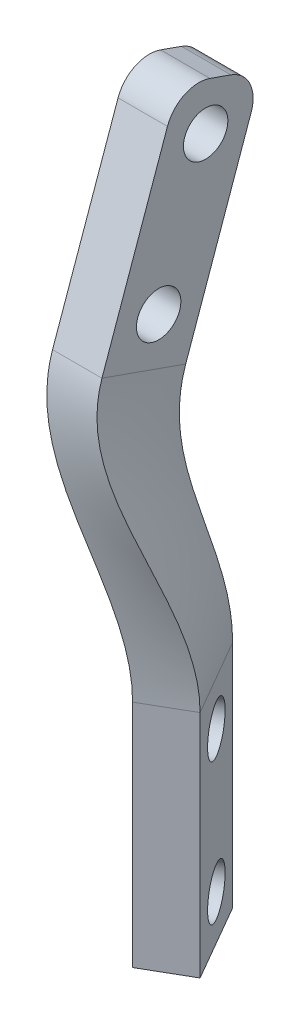
ISO-10303-21;
HEADER;
FILE_DESCRIPTION(('STEP AP214'),'2;1');
FILE_NAME('part.step','',(''),(''),'','','');
FILE_SCHEMA(('AUTOMOTIVE_DESIGN { 1 0 10303 214 1 1 1 1 }'));
ENDSEC;
DATA;
#1=APPLICATION_CONTEXT('core data for automotive mechanical design processes');
#2=APPLICATION_PROTOCOL_DEFINITION('international standard','automotive_design',2000,#1);
#3=PRODUCT_CONTEXT('',#1,'mechanical');
#4=PRODUCT('Part','Part','',(#3));
#5=PRODUCT_RELATED_PRODUCT_CATEGORY('part','',(#4));
#6=PRODUCT_DEFINITION_FORMATION('','',#4);
#7=PRODUCT_DEFINITION_CONTEXT('part definition',#1,'design');
#8=PRODUCT_DEFINITION('design','',#6,#7);
#9=PRODUCT_DEFINITION_SHAPE('','',#8);
#10=(LENGTH_UNIT() NAMED_UNIT(*) SI_UNIT(.MILLI.,.METRE.));
#11=(NAMED_UNIT(*) PLANE_ANGLE_UNIT() SI_UNIT($,.RADIAN.));
#12=(NAMED_UNIT(*) SI_UNIT($,.STERADIAN.) SOLID_ANGLE_UNIT());
#13=UNCERTAINTY_MEASURE_WITH_UNIT(LENGTH_MEASURE(1.E-05),#10,'distance_accuracy_value','');
#14=(GEOMETRIC_REPRESENTATION_CONTEXT(3) GLOBAL_UNCERTAINTY_ASSIGNED_CONTEXT((#13)) GLOBAL_UNIT_ASSIGNED_CONTEXT((#10,
#11,#12)) REPRESENTATION_CONTEXT('',''));
#15=CARTESIAN_POINT('',(0.,0.,0.));
#16=DIRECTION('',(0.,0.,1.));
#17=DIRECTION('',(1.,0.,0.));
#18=AXIS2_PLACEMENT_3D('',#15,#16,#17);
#19=CARTESIAN_POINT('',(-105.736696704946,0.,61.0471103058222));
#20=DIRECTION('',(0.866025403784439,0.,-0.5));
#21=DIRECTION('',(-0.5,0.,-0.866025403784439));
#22=AXIS2_PLACEMENT_3D('',#19,#20,#21);
#23=PLANE('',#22);
#24=CARTESIAN_POINT('',(-190.650199856964,-33.1766332140993,-86.0273914021332));
#25=DIRECTION('',(0.866025403784438,0.,-0.500000000000001));
#26=DIRECTION('',(-0.500000000000001,0.,-0.866025403784438));
#27=AXIS2_PLACEMENT_3D('',#24,#25,#26);
#28=CIRCLE('',#27,2.15000000000005);
#29=CARTESIAN_POINT('',(-191.725199856964,-33.1766332140993,-87.8893460202698));
#30=VERTEX_POINT('',#29);
#31=EDGE_CURVE('E716',#30,#30,#28,.T.);
#32=ORIENTED_EDGE('',*,*,#31,.F.);
#33=EDGE_LOOP('',(#32));
#34=FACE_BOUND('',#33,.T.);
#35=DIRECTION('',(0.,-1.,0.));
#36=VECTOR('',#35,1.);
#37=CARTESIAN_POINT('',(-188.650199856964,-16.4766332140994,-82.5632897869954));
#38=LINE('',#37,#36);
#39=CARTESIAN_POINT('',(-188.650199856964,-16.4766332140993,-82.5632897869954));
#40=VERTEX_POINT('',#39);
#41=CARTESIAN_POINT('',(-188.650199856964,-37.1766332140993,-82.5632897869954));
#42=VERTEX_POINT('',#41);
#43=EDGE_CURVE('E701',#40,#42,#38,.T.);
#44=ORIENTED_EDGE('',*,*,#43,.T.);
#45=DIRECTION('',(-0.5,0.,-0.866025403784439));
#46=VECTOR('',#45,1.);
#47=CARTESIAN_POINT('',(-188.650199856964,-37.1766332140993,-82.5632897869954));
#48=LINE('',#47,#46);
#49=CARTESIAN_POINT('',(-192.650199856964,-37.1766332140993,-89.4914930172709));
#50=VERTEX_POINT('',#49);
#51=EDGE_CURVE('E712',#42,#50,#48,.T.);
#52=ORIENTED_EDGE('',*,*,#51,.T.);
#53=DIRECTION('',(0.,1.,0.));
#54=VECTOR('',#53,1.);
#55=CARTESIAN_POINT('',(-192.650199856964,-16.4766332140993,-89.4914930172709));
#56=LINE('',#55,#54);
#57=CARTESIAN_POINT('',(-192.650199856964,-16.4766332140993,-89.4914930172709));
#58=VERTEX_POINT('',#57);
#59=EDGE_CURVE('E709',#50,#58,#56,.T.);
#60=ORIENTED_EDGE('',*,*,#59,.T.);
#61=DIRECTION('',(-0.5,0.,-0.866025403784439));
#62=VECTOR('',#61,1.);
#63=CARTESIAN_POINT('',(-105.736696704946,-16.4766332140993,61.0471103058222));
#64=LINE('',#63,#62);
#65=EDGE_CURVE('E711',#58,#40,#64,.F.);
#66=ORIENTED_EDGE('',*,*,#65,.T.);
#67=EDGE_LOOP('',(#44,#52,#60,#66));
#68=FACE_BOUND('',#67,.T.);
#69=CARTESIAN_POINT('',(-190.650199856964,-20.4766332140994,-86.0273914021332));
#70=DIRECTION('',(0.866025403784438,0.,-0.500000000000001));
#71=DIRECTION('',(-0.500000000000001,0.,-0.866025403784438));
#72=AXIS2_PLACEMENT_3D('',#69,#70,#71);
#73=CIRCLE('',#72,2.15000000000005);
#74=CARTESIAN_POINT('',(-191.725199856964,-20.4766332140994,-87.8893460202698));
#75=VERTEX_POINT('',#74);
#76=EDGE_CURVE('E818',#75,#75,#73,.T.);
#77=ORIENTED_EDGE('',*,*,#76,.F.);
#78=EDGE_LOOP('',(#77));
#79=FACE_BOUND('',#78,.T.);
#80=ADVANCED_FACE('F279',(#34,#68,#79),#23,.T.);
#81=CARTESIAN_POINT('',(-109.590509751786,0.,63.2721103058222));
#82=DIRECTION('',(0.866025403784439,0.,-0.5));
#83=DIRECTION('',(-0.5,0.,-0.866025403784439));
#84=AXIS2_PLACEMENT_3D('',#81,#82,#83);
#85=PLANE('',#84);
#86=DIRECTION('',(0.,-1.,0.));
#87=VECTOR('',#86,1.);
#88=CARTESIAN_POINT('',(-192.504012903805,-16.4766332140994,-80.3382897869954));
#89=LINE('',#88,#87);
#90=CARTESIAN_POINT('',(-192.504012903805,-16.4766332140994,-80.3382897869954));
#91=VERTEX_POINT('',#90);
#92=CARTESIAN_POINT('',(-192.504012903805,-37.1766332140993,-80.3382897869954));
#93=VERTEX_POINT('',#92);
#94=EDGE_CURVE('E703',#91,#93,#89,.T.);
#95=ORIENTED_EDGE('',*,*,#94,.F.);
#96=DIRECTION('',(-0.5,0.,-0.866025403784439));
#97=VECTOR('',#96,1.);
#98=CARTESIAN_POINT('',(-109.590509751786,-16.4766332140994,63.2721103058222));
#99=LINE('',#98,#97);
#100=CARTESIAN_POINT('',(-196.504012903805,-16.4766332140993,-87.2664930172709));
#101=VERTEX_POINT('',#100);
#102=EDGE_CURVE('E698',#101,#91,#99,.F.);
#103=ORIENTED_EDGE('',*,*,#102,.F.);
#104=DIRECTION('',(0.,1.,0.));
#105=VECTOR('',#104,1.);
#106=CARTESIAN_POINT('',(-196.504012903805,-16.4766332140993,-87.2664930172709));
#107=LINE('',#106,#105);
#108=CARTESIAN_POINT('',(-196.504012903805,-37.1766332140993,-87.2664930172709));
#109=VERTEX_POINT('',#108);
#110=EDGE_CURVE('E692',#109,#101,#107,.T.);
#111=ORIENTED_EDGE('',*,*,#110,.F.);
#112=DIRECTION('',(-0.5,0.,-0.866025403784439));
#113=VECTOR('',#112,1.);
#114=CARTESIAN_POINT('',(-192.504012903805,-37.1766332140993,-80.3382897869954));
#115=LINE('',#114,#113);
#116=EDGE_CURVE('E699',#93,#109,#115,.T.);
#117=ORIENTED_EDGE('',*,*,#116,.F.);
#118=EDGE_LOOP('',(#95,#103,#111,#117));
#119=FACE_BOUND('',#118,.T.);
#120=CARTESIAN_POINT('',(-194.504012903805,-33.1766332140993,-83.8023914021332));
#121=DIRECTION('',(0.866025403784438,0.,-0.500000000000001));
#122=DIRECTION('',(-0.500000000000001,0.,-0.866025403784438));
#123=AXIS2_PLACEMENT_3D('',#120,#121,#122);
#124=CIRCLE('',#123,2.15000000000005);
#125=CARTESIAN_POINT('',(-195.579012903805,-33.1766332140993,-85.6643460202698));
#126=VERTEX_POINT('',#125);
#127=EDGE_CURVE('E821',#126,#126,#124,.T.);
#128=ORIENTED_EDGE('',*,*,#127,.T.);
#129=EDGE_LOOP('',(#128));
#130=FACE_BOUND('',#129,.T.);
#131=CARTESIAN_POINT('',(-194.504012903805,-20.4766332140994,-83.8023914021332));
#132=DIRECTION('',(0.866025403784438,0.,-0.500000000000001));
#133=DIRECTION('',(-0.500000000000001,0.,-0.866025403784438));
#134=AXIS2_PLACEMENT_3D('',#131,#132,#133);
#135=CIRCLE('',#134,2.15000000000005);
#136=CARTESIAN_POINT('',(-195.579012903805,-20.4766332140994,-85.6643460202698));
#137=VERTEX_POINT('',#136);
#138=EDGE_CURVE('E822',#137,#137,#135,.T.);
#139=ORIENTED_EDGE('',*,*,#138,.T.);
#140=EDGE_LOOP('',(#139));
#141=FACE_BOUND('',#140,.T.);
#142=ADVANCED_FACE('F493',(#119,#130,#141),#85,.F.);
#143=CARTESIAN_POINT('',(-188.650199856964,-16.4766332140994,-82.5632897869954));
#144=DIRECTION('',(-0.500000000000001,0.,-0.866025403784438));
#145=DIRECTION('',(-0.866025403784438,0.,0.500000000000001));
#146=AXIS2_PLACEMENT_3D('',#143,#144,#145);
#147=PLANE('',#146);
#148=ORIENTED_EDGE('',*,*,#94,.T.);
#149=DIRECTION('',(-0.866025403784438,0.,0.500000000000001));
#150=VECTOR('',#149,1.);
#151=CARTESIAN_POINT('',(-188.650199856964,-37.1766332140993,-82.5632897869954));
#152=LINE('',#151,#150);
#153=EDGE_CURVE('E707',#42,#93,#152,.T.);
#154=ORIENTED_EDGE('',*,*,#153,.F.);
#155=ORIENTED_EDGE('',*,*,#43,.F.);
#156=DIRECTION('',(-0.866025403784438,0.,0.500000000000001));
#157=VECTOR('',#156,1.);
#158=CARTESIAN_POINT('',(-188.650199856964,-16.4766332140994,-82.5632897869954));
#159=LINE('',#158,#157);
#160=EDGE_CURVE('E719',#40,#91,#159,.T.);
#161=ORIENTED_EDGE('',*,*,#160,.T.);
#162=EDGE_LOOP('',(#148,#154,#155,#161));
#163=FACE_BOUND('',#162,.T.);
#164=ADVANCED_FACE('F545',(#163),#147,.F.);
#165=CARTESIAN_POINT('',(-188.650199856964,-37.1766332140993,-82.5632897869954));
#166=DIRECTION('',(0.,1.,0.));
#167=DIRECTION('',(-1.,0.,0.));
#168=AXIS2_PLACEMENT_3D('',#165,#166,#167);
#169=PLANE('',#168);
#170=ORIENTED_EDGE('',*,*,#116,.T.);
#171=DIRECTION('',(-0.866025403784438,0.,0.500000000000001));
#172=VECTOR('',#171,1.);
#173=CARTESIAN_POINT('',(-192.650199856964,-37.1766332140993,-89.4914930172709));
#174=LINE('',#173,#172);
#175=EDGE_CURVE('E696',#50,#109,#174,.T.);
#176=ORIENTED_EDGE('',*,*,#175,.F.);
#177=ORIENTED_EDGE('',*,*,#51,.F.);
#178=ORIENTED_EDGE('',*,*,#153,.T.);
#179=EDGE_LOOP('',(#170,#176,#177,#178));
#180=FACE_BOUND('',#179,.T.);
#181=ADVANCED_FACE('F554',(#180),#169,.F.);
#182=CARTESIAN_POINT('',(-192.650199856964,-16.4766332140993,-89.4914930172709));
#183=DIRECTION('',(0.500000000000001,0.,0.866025403784438));
#184=DIRECTION('',(0.866025403784438,0.,-0.500000000000001));
#185=AXIS2_PLACEMENT_3D('',#182,#183,#184);
#186=PLANE('',#185);
#187=ORIENTED_EDGE('',*,*,#110,.T.);
#188=DIRECTION('',(0.866025403784438,0.,-0.500000000000001));
#189=VECTOR('',#188,1.);
#190=CARTESIAN_POINT('',(-192.650199856964,-16.4766332140993,-89.4914930172709));
#191=LINE('',#190,#189);
#192=EDGE_CURVE('E367',#58,#101,#191,.F.);
#193=ORIENTED_EDGE('',*,*,#192,.F.);
#194=ORIENTED_EDGE('',*,*,#59,.F.);
#195=ORIENTED_EDGE('',*,*,#175,.T.);
#196=EDGE_LOOP('',(#187,#193,#194,#195));
#197=FACE_BOUND('',#196,.T.);
#198=ADVANCED_FACE('F489',(#197),#186,.F.);
#199=CARTESIAN_POINT('',(-190.650199856964,-33.1766332140993,-86.0273914021332));
#200=DIRECTION('',(-0.866025403784438,0.,0.500000000000001));
#201=DIRECTION('',(0.500000000000001,0.,0.866025403784438));
#202=AXIS2_PLACEMENT_3D('',#199,#200,#201);
#203=CYLINDRICAL_SURFACE('',#202,2.15000000000005);
#204=ORIENTED_EDGE('',*,*,#31,.T.);
#205=EDGE_LOOP('',(#204));
#206=FACE_BOUND('',#205,.T.);
#207=ORIENTED_EDGE('',*,*,#127,.F.);
#208=EDGE_LOOP('',(#207));
#209=FACE_BOUND('',#208,.T.);
#210=ADVANCED_FACE('F485',(#206,#209),#203,.F.);
#211=CARTESIAN_POINT('',(-190.650199856964,-20.4766332140994,-86.0273914021332));
#212=DIRECTION('',(-0.866025403784438,0.,0.500000000000001));
#213=DIRECTION('',(0.500000000000001,0.,0.866025403784438));
#214=AXIS2_PLACEMENT_3D('',#211,#212,#213);
#215=CYLINDRICAL_SURFACE('',#214,2.15000000000005);
#216=ORIENTED_EDGE('',*,*,#76,.T.);
#217=EDGE_LOOP('',(#216));
#218=FACE_BOUND('',#217,.T.);
#219=ORIENTED_EDGE('',*,*,#138,.F.);
#220=EDGE_LOOP('',(#219));
#221=FACE_BOUND('',#220,.T.);
#222=ADVANCED_FACE('F427',(#218,#221),#215,.F.);
#223=CARTESIAN_POINT('',(-192.504012903805,-16.4766332140994,-80.3382897869954));
#224=CARTESIAN_POINT('',(-192.504012903805,-7.53697597439596,-80.3382897869954));
#225=CARTESIAN_POINT('',(-197.091499962125,1.90145748462411,-74.8427636187892));
#226=CARTESIAN_POINT('',(-197.091499962125,10.0294230832178,-77.7164334147975));
#227=CARTESIAN_POINT('',(-191.861710729331,-16.4766332140994,-80.7091231203287));
#228=CARTESIAN_POINT('',(-191.861710729331,-7.53233491327276,-80.7091231203287));
#229=CARTESIAN_POINT('',(-196.349833295459,1.91262073999403,-74.8467104255753));
#230=CARTESIAN_POINT('',(-196.349833295459,10.0294230832178,-77.7164334147975));
#231=CARTESIAN_POINT('',(-190.577106380384,-16.4766332140994,-81.4507897869954));
#232=CARTESIAN_POINT('',(-190.577106380384,-7.52305279102637,-81.4507897869954));
#233=CARTESIAN_POINT('',(-194.866499962125,1.93494725073388,-74.8546040391475));
#234=CARTESIAN_POINT('',(-194.866499962125,10.0294230832178,-77.7164334147975));
#235=CARTESIAN_POINT('',(-189.292502031437,-16.4766332140994,-82.1924564536621));
#236=CARTESIAN_POINT('',(-189.292502031437,-7.50407146225316,-82.1924564536621));
#237=CARTESIAN_POINT('',(-193.383166628792,1.94812926186407,-74.8592645838774));
#238=CARTESIAN_POINT('',(-193.383166628792,10.0294230832178,-77.7164334147975));
#239=CARTESIAN_POINT('',(-188.650199856964,-16.4766332140994,-82.5632897869954));
#240=CARTESIAN_POINT('',(-188.650199856964,-7.49458079786655,-82.5632897869954));
#241=CARTESIAN_POINT('',(-192.641499962125,1.95472026742916,-74.8615948562424));
#242=CARTESIAN_POINT('',(-192.641499962125,10.0294230832178,-77.7164334147975));
#243=B_SPLINE_SURFACE_WITH_KNOTS('',3,3,((#223,#224,#225,#226),(#227,#228,#229,#230),(#231,#232,
#233,#234),(#235,#236,#237,#238),(#239,#240,#241,#242)),.UNSPECIFIED.,.F.,.F.,.F.,(4,1,4),(4,4),
(0.,0.5,1.),(0.,1.),.UNSPECIFIED.);
#244=CARTESIAN_POINT('',(-188.650199856964,-16.4766332140994,-82.5632897869954));
#245=CARTESIAN_POINT('',(-188.650199856964,-7.49458079786655,-82.5632897869954));
#246=CARTESIAN_POINT('',(-192.641499962125,1.95472026742916,-74.8615948562424));
#247=CARTESIAN_POINT('',(-192.641499962125,10.0294230832178,-77.7164334147975));
#248=B_SPLINE_CURVE_WITH_KNOTS('',3,(#244,#245,#246,#247),.UNSPECIFIED.,.F.,.F.,(4,4),(0.,1.),.UNSPECIFIED.);
#249=CARTESIAN_POINT('',(-192.641499962125,10.0294230832178,-77.7164334147975));
#250=VERTEX_POINT('',#249);
#251=EDGE_CURVE('E729',#40,#250,#248,.T.);
#252=DIRECTION('',(-1.,0.,0.));
#253=VECTOR('',#252,1.);
#254=CARTESIAN_POINT('',(-192.641499962125,10.0294230832178,-77.7164334147975));
#255=LINE('',#254,#253);
#256=CARTESIAN_POINT('',(-197.091499962125,10.0294230832178,-77.7164334147975));
#257=VERTEX_POINT('',#256);
#258=EDGE_CURVE('E728',#250,#257,#255,.T.);
#259=CARTESIAN_POINT('',(-192.504012903805,-16.4766332140994,-80.3382897869954));
#260=CARTESIAN_POINT('',(-192.504012903805,-7.53697597439596,-80.3382897869954));
#261=CARTESIAN_POINT('',(-197.091499962125,1.90145748462411,-74.8427636187892));
#262=CARTESIAN_POINT('',(-197.091499962125,10.0294230832178,-77.7164334147975));
#263=B_SPLINE_CURVE_WITH_KNOTS('',3,(#259,#260,#261,#262),.UNSPECIFIED.,.F.,.F.,(4,4),(0.,1.),.UNSPECIFIED.);
#264=EDGE_CURVE('E379',#257,#91,#263,.F.);
#265=ORIENTED_EDGE('',*,*,#160,.F.);
#266=ORIENTED_EDGE('',*,*,#251,.T.);
#267=ORIENTED_EDGE('',*,*,#258,.T.);
#268=ORIENTED_EDGE('',*,*,#264,.T.);
#269=EDGE_LOOP('',(#265,#266,#267,#268));
#270=FACE_BOUND('',#269,.T.);
#271=ADVANCED_FACE('F420',(#270),#243,.T.);
#272=CARTESIAN_POINT('',(-188.650199856964,-16.4766332140994,-82.5632897869954));
#273=CARTESIAN_POINT('',(-188.650199856964,-7.49458079786655,-82.5632897869954));
#274=CARTESIAN_POINT('',(-192.641499962125,1.95472026742916,-74.8615948562424));
#275=CARTESIAN_POINT('',(-192.641499962125,10.0294230832178,-77.7164334147975));
#276=CARTESIAN_POINT('',(-189.31686652363,-16.4766332140994,-83.7179903253747));
#277=CARTESIAN_POINT('',(-189.31686652363,-7.66172065508388,-83.7179903253747));
#278=CARTESIAN_POINT('',(-192.641499962125,1.66037160872435,-76.1717404523138));
#279=CARTESIAN_POINT('',(-192.641499962125,9.58497863877331,-78.9735121369069));
#280=CARTESIAN_POINT('',(-190.650199856964,-16.4766332140993,-86.0273914021332));
#281=CARTESIAN_POINT('',(-190.650199856964,-7.99600036951852,-86.0273914021332));
#282=CARTESIAN_POINT('',(-192.641499962125,1.07167429131473,-78.7920316444567));
#283=CARTESIAN_POINT('',(-192.641499962125,8.69608974988443,-81.4876695811257));
#284=CARTESIAN_POINT('',(-191.983533190297,-16.4766332140993,-88.3367924788917));
#285=CARTESIAN_POINT('',(-191.983533190297,-8.30240337284036,-88.3367924788917));
#286=CARTESIAN_POINT('',(-192.641499962125,0.456694558618404,-81.4030305995619));
#287=CARTESIAN_POINT('',(-192.641499962125,7.80720086099554,-84.0018270253446));
#288=CARTESIAN_POINT('',(-192.650199856964,-16.4766332140993,-89.4914930172709));
#289=CARTESIAN_POINT('',(-192.650199856964,-8.45560487450128,-89.4914930172709));
#290=CARTESIAN_POINT('',(-192.641499962125,0.149204692270239,-82.7085300771145));
#291=CARTESIAN_POINT('',(-192.641499962125,7.3627564165511,-85.258905747454));
#292=B_SPLINE_SURFACE_WITH_KNOTS('',3,3,((#272,#273,#274,#275),(#276,#277,#278,#279),(#280,#281,
#282,#283),(#284,#285,#286,#287),(#288,#289,#290,#291)),.UNSPECIFIED.,.F.,.F.,.F.,(4,1,4),(4,4),
(0.,0.5,1.),(0.,1.),.UNSPECIFIED.);
#293=CARTESIAN_POINT('',(-192.650199856964,-16.4766332140993,-89.4914930172709));
#294=CARTESIAN_POINT('',(-192.650199856964,-8.45560487450128,-89.4914930172709));
#295=CARTESIAN_POINT('',(-192.641499962125,0.149204692270239,-82.7085300771145));
#296=CARTESIAN_POINT('',(-192.641499962125,7.3627564165511,-85.258905747454));
#297=B_SPLINE_CURVE_WITH_KNOTS('',3,(#293,#294,#295,#296),.UNSPECIFIED.,.F.,.F.,(4,4),(0.,1.),.UNSPECIFIED.);
#298=CARTESIAN_POINT('',(-192.641499962125,7.3627564165511,-85.258905747454));
#299=VERTEX_POINT('',#298);
#300=EDGE_CURVE('E371',#58,#299,#297,.T.);
#301=DIRECTION('',(0.,-0.333333333333333,-0.942809041582064));
#302=VECTOR('',#301,1.);
#303=CARTESIAN_POINT('',(-192.641499962125,10.0294230832178,-77.7164334147975));
#304=LINE('',#303,#302);
#305=EDGE_CURVE('E399',#250,#299,#304,.T.);
#306=ORIENTED_EDGE('',*,*,#65,.F.);
#307=ORIENTED_EDGE('',*,*,#300,.T.);
#308=ORIENTED_EDGE('',*,*,#305,.F.);
#309=ORIENTED_EDGE('',*,*,#251,.F.);
#310=EDGE_LOOP('',(#306,#307,#308,#309));
#311=FACE_BOUND('',#310,.T.);
#312=ADVANCED_FACE('F426',(#311),#292,.T.);
#313=CARTESIAN_POINT('',(-196.504012903805,-16.4766332140993,-87.2664930172709));
#314=CARTESIAN_POINT('',(-196.504012903805,-8.51185091922592,-87.2664930172709));
#315=CARTESIAN_POINT('',(-197.091499962125,0.10900063323341,-82.6943157957264));
#316=CARTESIAN_POINT('',(-197.091499962125,7.3627564165511,-85.258905747454));
#317=CARTESIAN_POINT('',(-195.837346237138,-16.4766332140993,-86.1117924788917));
#318=CARTESIAN_POINT('',(-195.837346237138,-8.35619994366006,-86.1117924788917));
#319=CARTESIAN_POINT('',(-197.091499962125,0.414181113436894,-81.3879998268722));
#320=CARTESIAN_POINT('',(-197.091499962125,7.80720086099554,-84.0018270253446));
#321=CARTESIAN_POINT('',(-194.504012903805,-16.4766332140993,-83.8023914021332));
#322=CARTESIAN_POINT('',(-194.504012903805,-8.04489799252836,-83.8023914021332));
#323=CARTESIAN_POINT('',(-197.091499962125,1.02454207384386,-78.7753678891636));
#324=CARTESIAN_POINT('',(-197.091499962125,8.69608974988443,-81.4876695811257));
#325=CARTESIAN_POINT('',(-193.170679570471,-16.4766332140994,-81.4929903253747));
#326=CARTESIAN_POINT('',(-193.170679570471,-7.70628331377343,-81.4929903253747));
#327=CARTESIAN_POINT('',(-197.091499962125,1.60915234769736,-76.153631708914));
#328=CARTESIAN_POINT('',(-197.091499962125,9.58497863877331,-78.9735121369069));
#329=CARTESIAN_POINT('',(-192.504012903805,-16.4766332140994,-80.3382897869954));
#330=CARTESIAN_POINT('',(-192.504012903805,-7.53697597439596,-80.3382897869954));
#331=CARTESIAN_POINT('',(-197.091499962125,1.9014574846241,-74.8427636187892));
#332=CARTESIAN_POINT('',(-197.091499962125,10.0294230832178,-77.7164334147975));
#333=B_SPLINE_SURFACE_WITH_KNOTS('',3,3,((#313,#314,#315,#316),(#317,#318,#319,#320),(#321,#322,
#323,#324),(#325,#326,#327,#328),(#329,#330,#331,#332)),.UNSPECIFIED.,.F.,.F.,.F.,(4,1,4),(4,4),
(0.,0.5,1.),(0.,1.),.UNSPECIFIED.);
#334=DIRECTION('',(0.,-0.333333333333333,-0.942809041582064));
#335=VECTOR('',#334,1.);
#336=CARTESIAN_POINT('',(-197.091499962125,10.0294230832178,-77.7164334147975));
#337=LINE('',#336,#335);
#338=CARTESIAN_POINT('',(-197.091499962125,7.3627564165511,-85.258905747454));
#339=VERTEX_POINT('',#338);
#340=EDGE_CURVE('E370',#257,#339,#337,.T.);
#341=CARTESIAN_POINT('',(-196.504012903805,-16.4766332140993,-87.2664930172709));
#342=CARTESIAN_POINT('',(-196.504012903805,-8.51185091922592,-87.2664930172709));
#343=CARTESIAN_POINT('',(-197.091499962125,0.10900063323341,-82.6943157957264));
#344=CARTESIAN_POINT('',(-197.091499962125,7.3627564165511,-85.258905747454));
#345=B_SPLINE_CURVE_WITH_KNOTS('',3,(#341,#342,#343,#344),.UNSPECIFIED.,.F.,.F.,(4,4),(0.,1.),.UNSPECIFIED.);
#346=EDGE_CURVE('E358',#101,#339,#345,.T.);
#347=ORIENTED_EDGE('',*,*,#102,.T.);
#348=ORIENTED_EDGE('',*,*,#264,.F.);
#349=ORIENTED_EDGE('',*,*,#340,.T.);
#350=ORIENTED_EDGE('',*,*,#346,.F.);
#351=EDGE_LOOP('',(#347,#348,#349,#350));
#352=FACE_BOUND('',#351,.T.);
#353=ADVANCED_FACE('F377',(#352),#333,.T.);
#354=CARTESIAN_POINT('',(-192.650199856964,-16.4766332140993,-89.4914930172709));
#355=CARTESIAN_POINT('',(-192.650199856964,-8.45560487450128,-89.4914930172709));
#356=CARTESIAN_POINT('',(-192.641499962125,0.149204692270239,-82.7085300771145));
#357=CARTESIAN_POINT('',(-192.641499962125,7.3627564165511,-85.258905747454));
#358=CARTESIAN_POINT('',(-193.292502031437,-16.4766332140993,-89.1206596839376));
#359=CARTESIAN_POINT('',(-193.292502031437,-8.46769503168226,-89.1206596839376));
#360=CARTESIAN_POINT('',(-193.383166628792,0.145064512015209,-82.7070663023477));
#361=CARTESIAN_POINT('',(-193.383166628792,7.3627564165511,-85.258905747454));
#362=CARTESIAN_POINT('',(-194.577106380384,-16.4766332140993,-88.3789930172709));
#363=CARTESIAN_POINT('',(-194.577106380384,-8.49187534604422,-88.3789930172709));
#364=CARTESIAN_POINT('',(-194.866499962125,0.136784151505148,-82.704138752814));
#365=CARTESIAN_POINT('',(-194.866499962125,7.3627564165511,-85.258905747454));
#366=CARTESIAN_POINT('',(-195.861710729331,-16.4766332140993,-87.6373263506043));
#367=CARTESIAN_POINT('',(-195.861710729331,-8.50519239483202,-87.6373263506042));
#368=CARTESIAN_POINT('',(-196.349833295459,0.118261805990655,-82.6975901147556));
#369=CARTESIAN_POINT('',(-196.349833295459,7.3627564165511,-85.258905747454));
#370=CARTESIAN_POINT('',(-196.504012903805,-16.4766332140993,-87.2664930172709));
#371=CARTESIAN_POINT('',(-196.504012903805,-8.51185091922592,-87.2664930172709));
#372=CARTESIAN_POINT('',(-197.091499962125,0.10900063323341,-82.6943157957264));
#373=CARTESIAN_POINT('',(-197.091499962125,7.3627564165511,-85.258905747454));
#374=B_SPLINE_SURFACE_WITH_KNOTS('',3,3,((#354,#355,#356,#357),(#358,#359,#360,#361),(#362,#363,
#364,#365),(#366,#367,#368,#369),(#370,#371,#372,#373)),.UNSPECIFIED.,.F.,.F.,.F.,(4,1,4),(4,4),
(0.,0.5,1.),(0.,1.),.UNSPECIFIED.);
#375=DIRECTION('',(-1.,0.,0.));
#376=VECTOR('',#375,1.);
#377=CARTESIAN_POINT('',(-192.641499962125,7.3627564165511,-85.258905747454));
#378=LINE('',#377,#376);
#379=EDGE_CURVE('E363',#299,#339,#378,.T.);
#380=ORIENTED_EDGE('',*,*,#192,.T.);
#381=ORIENTED_EDGE('',*,*,#346,.T.);
#382=ORIENTED_EDGE('',*,*,#379,.F.);
#383=ORIENTED_EDGE('',*,*,#300,.F.);
#384=EDGE_LOOP('',(#380,#381,#382,#383));
#385=FACE_BOUND('',#384,.T.);
#386=ADVANCED_FACE('F360',(#385),#374,.T.);
#387=CARTESIAN_POINT('',(-192.641499962125,0.,0.));
#388=DIRECTION('',(1.,0.,0.));
#389=DIRECTION('',(0.,0.,-1.));
#390=AXIS2_PLACEMENT_3D('',#387,#388,#389);
#391=PLANE('',#390);
#392=CARTESIAN_POINT('',(-192.641499962125,24.4410007442855,-87.0543362477855));
#393=DIRECTION('',(1.,0.,0.));
#394=DIRECTION('',(0.,1.,0.));
#395=AXIS2_PLACEMENT_3D('',#392,#393,#394);
#396=CIRCLE('',#395,1.99999999963518);
#397=CARTESIAN_POINT('',(-192.641499962125,26.4410007439207,-87.0543362477855));
#398=VERTEX_POINT('',#397);
#399=EDGE_CURVE('E393',#398,#398,#396,.T.);
#400=ORIENTED_EDGE('',*,*,#399,.F.);
#401=EDGE_LOOP('',(#400));
#402=FACE_BOUND('',#401,.T.);
#403=DIRECTION('',(0.,0.333333333333332,0.942809041582064));
#404=VECTOR('',#403,1.);
#405=CARTESIAN_POINT('',(-192.641499962125,26.8789035772804,-92.1589057474471));
#406=LINE('',#405,#404);
#407=CARTESIAN_POINT('',(-192.641499962125,27.8789035772804,-89.3304786227009));
#408=VERTEX_POINT('',#407);
#409=CARTESIAN_POINT('',(-192.641499962125,28.5455702439471,-87.4448605395368));
#410=VERTEX_POINT('',#409);
#411=EDGE_CURVE('E733',#408,#410,#406,.T.);
#412=ORIENTED_EDGE('',*,*,#411,.T.);
#413=CARTESIAN_POINT('',(-192.641499962125,25.7171431192009,-86.4448605395368));
#414=DIRECTION('',(1.,0.,0.));
#415=DIRECTION('',(0.,0.,-1.));
#416=AXIS2_PLACEMENT_3D('',#413,#414,#415);
#417=CIRCLE('',#416,3.);
#418=CARTESIAN_POINT('',(-192.641499962125,26.7171431192009,-83.6164334147906));
#419=VERTEX_POINT('',#418);
#420=EDGE_CURVE('E287',#410,#419,#417,.T.);
#421=ORIENTED_EDGE('',*,*,#420,.T.);
#422=DIRECTION('',(0.,-0.942809041582064,0.333333333333332));
#423=VECTOR('',#422,1.);
#424=CARTESIAN_POINT('',(-192.641499962125,29.5455702439471,-84.6164334147906));
#425=LINE('',#424,#423);
#426=EDGE_CURVE('E730',#419,#250,#425,.T.);
#427=ORIENTED_EDGE('',*,*,#426,.T.);
#428=ORIENTED_EDGE('',*,*,#305,.T.);
#429=DIRECTION('',(0.,0.942809041582063,-0.333333333333333));
#430=VECTOR('',#429,1.);
#431=CARTESIAN_POINT('',(-192.641499962125,7.3627564165511,-85.258905747454));
#432=LINE('',#431,#430);
#433=CARTESIAN_POINT('',(-192.641499962125,24.0504764525342,-91.1589057474471));
#434=VERTEX_POINT('',#433);
#435=EDGE_CURVE('E397',#299,#434,#432,.T.);
#436=ORIENTED_EDGE('',*,*,#435,.T.);
#437=CARTESIAN_POINT('',(-192.641499962125,25.0504764525342,-88.3304786227009));
#438=DIRECTION('',(1.,0.,0.));
#439=DIRECTION('',(0.,0.,-1.));
#440=AXIS2_PLACEMENT_3D('',#437,#438,#439);
#441=CIRCLE('',#440,3.);
#442=EDGE_CURVE('E844',#434,#408,#441,.T.);
#443=ORIENTED_EDGE('',*,*,#442,.T.);
#444=EDGE_LOOP('',(#412,#421,#427,#428,#436,#443));
#445=FACE_BOUND('',#444,.T.);
#446=CARTESIAN_POINT('',(-192.641499962125,12.4673259162127,-82.8210029144591));
#447=DIRECTION('',(1.,0.,0.));
#448=DIRECTION('',(0.,1.,0.));
#449=AXIS2_PLACEMENT_3D('',#446,#447,#448);
#450=CIRCLE('',#449,1.99999999962298);
#451=CARTESIAN_POINT('',(-192.641499962125,14.4673259158357,-82.8210029144591));
#452=VERTEX_POINT('',#451);
#453=EDGE_CURVE('E770',#452,#452,#450,.T.);
#454=ORIENTED_EDGE('',*,*,#453,.F.);
#455=EDGE_LOOP('',(#454));
#456=FACE_BOUND('',#455,.T.);
#457=ADVANCED_FACE('F474',(#402,#445,#456),#391,.T.);
#458=CARTESIAN_POINT('',(-197.091499962125,0.,0.));
#459=DIRECTION('',(1.,0.,0.));
#460=DIRECTION('',(0.,0.,-1.));
#461=AXIS2_PLACEMENT_3D('',#458,#459,#460);
#462=PLANE('',#461);
#463=DIRECTION('',(0.,-0.942809041582064,0.333333333333332));
#464=VECTOR('',#463,1.);
#465=CARTESIAN_POINT('',(-197.091499962125,29.5455702439471,-84.6164334147906));
#466=LINE('',#465,#464);
#467=CARTESIAN_POINT('',(-197.091499962125,26.7171431192009,-83.6164334147906));
#468=VERTEX_POINT('',#467);
#469=EDGE_CURVE('E765',#468,#257,#466,.T.);
#470=ORIENTED_EDGE('',*,*,#469,.F.);
#471=CARTESIAN_POINT('',(-197.091499962125,25.7171431192009,-86.4448605395368));
#472=DIRECTION('',(1.,0.,0.));
#473=DIRECTION('',(0.,0.,-1.));
#474=AXIS2_PLACEMENT_3D('',#471,#472,#473);
#475=CIRCLE('',#474,3.);
#476=CARTESIAN_POINT('',(-197.091499962125,28.5455702439471,-87.4448605395368));
#477=VERTEX_POINT('',#476);
#478=EDGE_CURVE('E835',#468,#477,#475,.F.);
#479=ORIENTED_EDGE('',*,*,#478,.T.);
#480=DIRECTION('',(0.,0.333333333333332,0.942809041582064));
#481=VECTOR('',#480,1.);
#482=CARTESIAN_POINT('',(-197.091499962125,26.8789035772804,-92.1589057474471));
#483=LINE('',#482,#481);
#484=CARTESIAN_POINT('',(-197.091499962125,27.8789035772804,-89.3304786227009));
#485=VERTEX_POINT('',#484);
#486=EDGE_CURVE('E392',#485,#477,#483,.T.);
#487=ORIENTED_EDGE('',*,*,#486,.F.);
#488=CARTESIAN_POINT('',(-197.091499962125,25.0504764525342,-88.3304786227009));
#489=DIRECTION('',(1.,0.,0.));
#490=DIRECTION('',(0.,0.,-1.));
#491=AXIS2_PLACEMENT_3D('',#488,#489,#490);
#492=CIRCLE('',#491,3.);
#493=CARTESIAN_POINT('',(-197.091499962125,24.0504764525342,-91.1589057474471));
#494=VERTEX_POINT('',#493);
#495=EDGE_CURVE('E391',#485,#494,#492,.F.);
#496=ORIENTED_EDGE('',*,*,#495,.T.);
#497=DIRECTION('',(0.,0.942809041582063,-0.333333333333333));
#498=VECTOR('',#497,1.);
#499=CARTESIAN_POINT('',(-197.091499962125,7.3627564165511,-85.258905747454));
#500=LINE('',#499,#498);
#501=EDGE_CURVE('E387',#339,#494,#500,.T.);
#502=ORIENTED_EDGE('',*,*,#501,.F.);
#503=ORIENTED_EDGE('',*,*,#340,.F.);
#504=EDGE_LOOP('',(#470,#479,#487,#496,#502,#503));
#505=FACE_BOUND('',#504,.T.);
#506=CARTESIAN_POINT('',(-197.091499962125,24.4410007442855,-87.0543362477855));
#507=DIRECTION('',(1.,0.,0.));
#508=DIRECTION('',(0.,1.,0.));
#509=AXIS2_PLACEMENT_3D('',#506,#507,#508);
#510=CIRCLE('',#509,1.99999999963518);
#511=CARTESIAN_POINT('',(-197.091499962125,26.4410007439207,-87.0543362477855));
#512=VERTEX_POINT('',#511);
#513=EDGE_CURVE('E767',#512,#512,#510,.T.);
#514=ORIENTED_EDGE('',*,*,#513,.T.);
#515=EDGE_LOOP('',(#514));
#516=FACE_BOUND('',#515,.T.);
#517=CARTESIAN_POINT('',(-197.091499962125,12.4673259162127,-82.8210029144591));
#518=DIRECTION('',(1.,0.,0.));
#519=DIRECTION('',(0.,1.,0.));
#520=AXIS2_PLACEMENT_3D('',#517,#518,#519);
#521=CIRCLE('',#520,1.99999999962298);
#522=CARTESIAN_POINT('',(-197.091499962125,14.4673259158357,-82.8210029144591));
#523=VERTEX_POINT('',#522);
#524=EDGE_CURVE('E773',#523,#523,#521,.T.);
#525=ORIENTED_EDGE('',*,*,#524,.T.);
#526=EDGE_LOOP('',(#525));
#527=FACE_BOUND('',#526,.T.);
#528=ADVANCED_FACE('F388',(#505,#516,#527),#462,.F.);
#529=CARTESIAN_POINT('',(-192.641499962125,7.3627564165511,-85.258905747454));
#530=DIRECTION('',(0.,0.333333333333333,0.942809041582064));
#531=DIRECTION('',(0.,-0.942809041582064,0.333333333333333));
#532=AXIS2_PLACEMENT_3D('',#529,#530,#531);
#533=PLANE('',#532);
#534=ORIENTED_EDGE('',*,*,#501,.T.);
#535=DIRECTION('',(-1.,0.,0.));
#536=VECTOR('',#535,1.);
#537=CARTESIAN_POINT('',(-192.641499962125,24.0504764525342,-91.1589057474471));
#538=LINE('',#537,#536);
#539=EDGE_CURVE('E13',#494,#434,#538,.F.);
#540=ORIENTED_EDGE('',*,*,#539,.T.);
#541=ORIENTED_EDGE('',*,*,#435,.F.);
#542=ORIENTED_EDGE('',*,*,#379,.T.);
#543=EDGE_LOOP('',(#534,#540,#541,#542));
#544=FACE_BOUND('',#543,.T.);
#545=ADVANCED_FACE('F396',(#544),#533,.F.);
#546=CARTESIAN_POINT('',(-192.641499962125,26.8789035772804,-92.1589057474471));
#547=DIRECTION('',(0.,-0.942809041582064,0.333333333333332));
#548=DIRECTION('',(0.,-0.333333333333332,-0.942809041582064));
#549=AXIS2_PLACEMENT_3D('',#546,#547,#548);
#550=PLANE('',#549);
#551=ORIENTED_EDGE('',*,*,#486,.T.);
#552=DIRECTION('',(-1.,0.,0.));
#553=VECTOR('',#552,1.);
#554=CARTESIAN_POINT('',(-192.641499962125,28.5455702439471,-87.4448605395368));
#555=LINE('',#554,#553);
#556=EDGE_CURVE('E300',#477,#410,#555,.F.);
#557=ORIENTED_EDGE('',*,*,#556,.T.);
#558=ORIENTED_EDGE('',*,*,#411,.F.);
#559=DIRECTION('',(-1.,0.,0.));
#560=VECTOR('',#559,1.);
#561=CARTESIAN_POINT('',(-192.641499962125,27.8789035772804,-89.3304786227009));
#562=LINE('',#561,#560);
#563=EDGE_CURVE('E840',#408,#485,#562,.T.);
#564=ORIENTED_EDGE('',*,*,#563,.T.);
#565=EDGE_LOOP('',(#551,#557,#558,#564));
#566=FACE_BOUND('',#565,.T.);
#567=ADVANCED_FACE('F418',(#566),#550,.F.);
#568=CARTESIAN_POINT('',(-192.641499962125,29.5455702439471,-84.6164334147906));
#569=DIRECTION('',(0.,-0.333333333333332,-0.942809041582064));
#570=DIRECTION('',(0.,0.942809041582064,-0.333333333333332));
#571=AXIS2_PLACEMENT_3D('',#568,#569,#570);
#572=PLANE('',#571);
#573=ORIENTED_EDGE('',*,*,#426,.F.);
#574=DIRECTION('',(-1.,0.,0.));
#575=VECTOR('',#574,1.);
#576=CARTESIAN_POINT('',(-192.641499962125,26.7171431192009,-83.6164334147906));
#577=LINE('',#576,#575);
#578=EDGE_CURVE('E829',#419,#468,#577,.T.);
#579=ORIENTED_EDGE('',*,*,#578,.T.);
#580=ORIENTED_EDGE('',*,*,#469,.T.);
#581=ORIENTED_EDGE('',*,*,#258,.F.);
#582=EDGE_LOOP('',(#573,#579,#580,#581));
#583=FACE_BOUND('',#582,.T.);
#584=ADVANCED_FACE('F847',(#583),#572,.F.);
#585=CARTESIAN_POINT('',(-192.641499962125,24.4410007442855,-87.0543362477855));
#586=DIRECTION('',(-1.,0.,0.));
#587=DIRECTION('',(0.,-1.,0.));
#588=AXIS2_PLACEMENT_3D('',#585,#586,#587);
#589=CYLINDRICAL_SURFACE('',#588,1.99999999963518);
#590=ORIENTED_EDGE('',*,*,#399,.T.);
#591=EDGE_LOOP('',(#590));
#592=FACE_BOUND('',#591,.T.);
#593=ORIENTED_EDGE('',*,*,#513,.F.);
#594=EDGE_LOOP('',(#593));
#595=FACE_BOUND('',#594,.T.);
#596=ADVANCED_FACE('F794',(#592,#595),#589,.F.);
#597=CARTESIAN_POINT('',(-192.641499962125,12.4673259162127,-82.8210029144591));
#598=DIRECTION('',(-1.,0.,0.));
#599=DIRECTION('',(0.,-1.,0.));
#600=AXIS2_PLACEMENT_3D('',#597,#598,#599);
#601=CYLINDRICAL_SURFACE('',#600,1.99999999962298);
#602=ORIENTED_EDGE('',*,*,#453,.T.);
#603=EDGE_LOOP('',(#602));
#604=FACE_BOUND('',#603,.T.);
#605=ORIENTED_EDGE('',*,*,#524,.F.);
#606=EDGE_LOOP('',(#605));
#607=FACE_BOUND('',#606,.T.);
#608=ADVANCED_FACE('F779',(#604,#607),#601,.F.);
#609=CARTESIAN_POINT('',(-192.641499962125,25.7171431192009,-86.4448605395368));
#610=DIRECTION('',(-1.,0.,0.));
#611=DIRECTION('',(0.,-1.,0.));
#612=AXIS2_PLACEMENT_3D('',#609,#610,#611);
#613=CYLINDRICAL_SURFACE('',#612,3.);
#614=ORIENTED_EDGE('',*,*,#420,.F.);
#615=ORIENTED_EDGE('',*,*,#556,.F.);
#616=ORIENTED_EDGE('',*,*,#478,.F.);
#617=ORIENTED_EDGE('',*,*,#578,.F.);
#618=EDGE_LOOP('',(#614,#615,#616,#617));
#619=FACE_BOUND('',#618,.T.);
#620=ADVANCED_FACE('F556',(#619),#613,.T.);
#621=CARTESIAN_POINT('',(-192.641499962125,25.0504764525342,-88.3304786227009));
#622=DIRECTION('',(-1.,0.,0.));
#623=DIRECTION('',(0.,-1.,0.));
#624=AXIS2_PLACEMENT_3D('',#621,#622,#623);
#625=CYLINDRICAL_SURFACE('',#624,3.);
#626=ORIENTED_EDGE('',*,*,#442,.F.);
#627=ORIENTED_EDGE('',*,*,#539,.F.);
#628=ORIENTED_EDGE('',*,*,#495,.F.);
#629=ORIENTED_EDGE('',*,*,#563,.F.);
#630=EDGE_LOOP('',(#626,#627,#628,#629));
#631=FACE_BOUND('',#630,.T.);
#632=ADVANCED_FACE('F281',(#631),#625,.T.);
#633=CLOSED_SHELL('',(#80,#142,#164,#181,#198,#210,#222,#271,#312,#353,#386,#457,#528,#545,#567,
#584,#596,#608,#620,#632));
#634=MANIFOLD_SOLID_BREP('B2',#633);
#635=ADVANCED_BREP_SHAPE_REPRESENTATION('',(#18,#634),#14);
#636=SHAPE_DEFINITION_REPRESENTATION(#9,#635);
ENDSEC;
END-ISO-10303-21;
